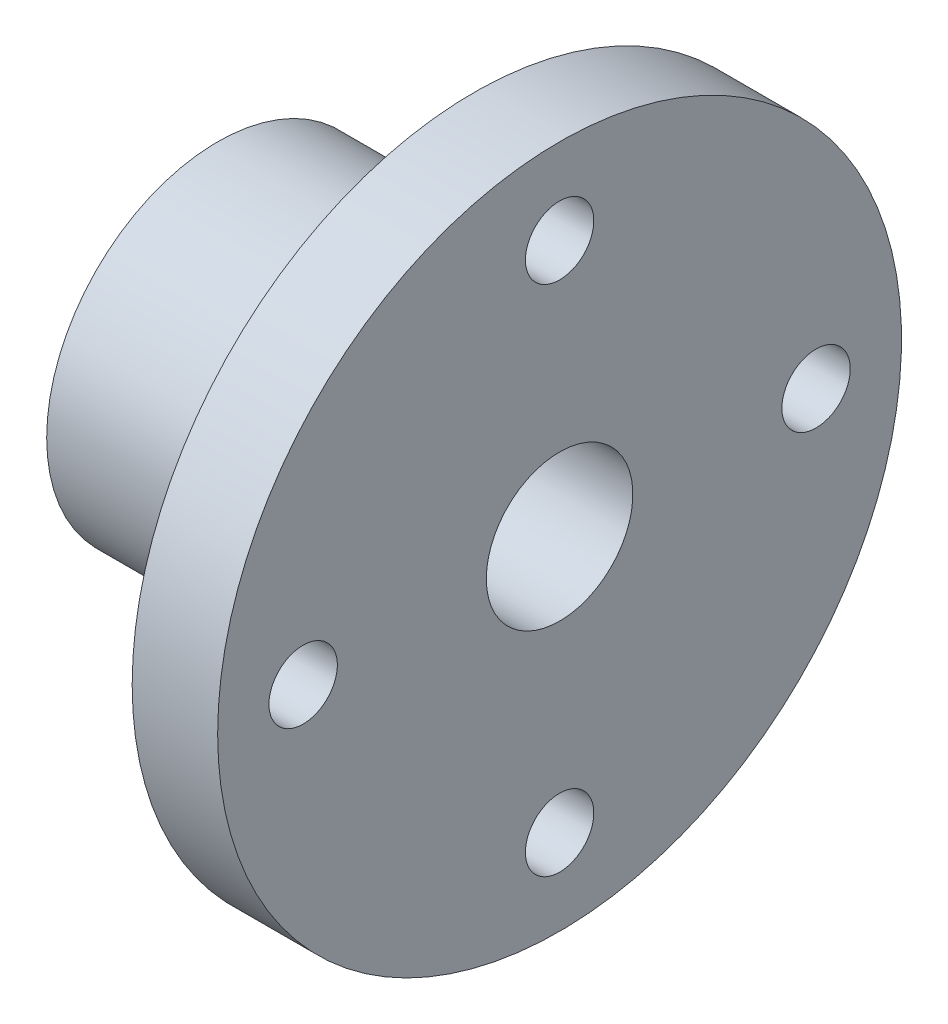
ISO-10303-21;
HEADER;
FILE_DESCRIPTION(('STEP AP214'),'2;1');
FILE_NAME('part.step','',(''),(''),'','','');
FILE_SCHEMA(('AUTOMOTIVE_DESIGN { 1 0 10303 214 1 1 1 1 }'));
ENDSEC;
DATA;
#1=APPLICATION_CONTEXT('core data for automotive mechanical design processes');
#2=APPLICATION_PROTOCOL_DEFINITION('international standard','automotive_design',2000,#1);
#3=PRODUCT_CONTEXT('',#1,'mechanical');
#4=PRODUCT('Part','Part','',(#3));
#5=PRODUCT_RELATED_PRODUCT_CATEGORY('part','',(#4));
#6=PRODUCT_DEFINITION_FORMATION('','',#4);
#7=PRODUCT_DEFINITION_CONTEXT('part definition',#1,'design');
#8=PRODUCT_DEFINITION('design','',#6,#7);
#9=PRODUCT_DEFINITION_SHAPE('','',#8);
#10=(LENGTH_UNIT() NAMED_UNIT(*) SI_UNIT(.MILLI.,.METRE.));
#11=(NAMED_UNIT(*) PLANE_ANGLE_UNIT() SI_UNIT($,.RADIAN.));
#12=(NAMED_UNIT(*) SI_UNIT($,.STERADIAN.) SOLID_ANGLE_UNIT());
#13=UNCERTAINTY_MEASURE_WITH_UNIT(LENGTH_MEASURE(1.E-05),#10,'distance_accuracy_value','');
#14=(GEOMETRIC_REPRESENTATION_CONTEXT(3) GLOBAL_UNCERTAINTY_ASSIGNED_CONTEXT((#13)) GLOBAL_UNIT_ASSIGNED_CONTEXT((#10,
#11,#12)) REPRESENTATION_CONTEXT('',''));
#15=CARTESIAN_POINT('',(0.,0.,0.));
#16=DIRECTION('',(0.,0.,1.));
#17=DIRECTION('',(1.,0.,0.));
#18=AXIS2_PLACEMENT_3D('',#15,#16,#17);
#19=CARTESIAN_POINT('',(12.0833333333333,0.,8.4));
#20=DIRECTION('',(-1.,0.,0.));
#21=DIRECTION('',(0.,0.,1.));
#22=AXIS2_PLACEMENT_3D('',#19,#20,#21);
#23=PLANE('',#22);
#24=CARTESIAN_POINT('',(12.0833333333333,0.,0.));
#25=DIRECTION('',(-1.,0.,0.));
#26=DIRECTION('',(0.,0.,1.));
#27=AXIS2_PLACEMENT_3D('',#24,#25,#26);
#28=CIRCLE('',#27,12.);
#29=CARTESIAN_POINT('',(12.0833333333333,0.,12.));
#30=VERTEX_POINT('',#29);
#31=EDGE_CURVE('E92',#30,#30,#28,.T.);
#32=ORIENTED_EDGE('',*,*,#31,.T.);
#33=EDGE_LOOP('',(#32));
#34=FACE_BOUND('',#33,.T.);
#35=CARTESIAN_POINT('',(12.0833333333333,0.,-42.));
#36=DIRECTION('',(-1.,0.,0.));
#37=DIRECTION('',(0.,0.,1.));
#38=AXIS2_PLACEMENT_3D('',#35,#36,#37);
#39=CIRCLE('',#38,5.6);
#40=CARTESIAN_POINT('',(12.0833333333333,0.,-36.4));
#41=VERTEX_POINT('',#40);
#42=EDGE_CURVE('E78',#41,#41,#39,.F.);
#43=ORIENTED_EDGE('',*,*,#42,.F.);
#44=EDGE_LOOP('',(#43));
#45=FACE_BOUND('',#44,.T.);
#46=CARTESIAN_POINT('',(12.0833333333333,0.,42.));
#47=DIRECTION('',(-1.,0.,0.));
#48=DIRECTION('',(0.,0.,1.));
#49=AXIS2_PLACEMENT_3D('',#46,#47,#48);
#50=CIRCLE('',#49,5.6);
#51=CARTESIAN_POINT('',(12.0833333333333,0.,47.6));
#52=VERTEX_POINT('',#51);
#53=EDGE_CURVE('E64',#52,#52,#50,.F.);
#54=ORIENTED_EDGE('',*,*,#53,.F.);
#55=EDGE_LOOP('',(#54));
#56=FACE_BOUND('',#55,.T.);
#57=CARTESIAN_POINT('',(12.0833333333333,0.,0.));
#58=DIRECTION('',(-1.,0.,0.));
#59=DIRECTION('',(0.,0.,1.));
#60=AXIS2_PLACEMENT_3D('',#57,#58,#59);
#61=CIRCLE('',#60,56.);
#62=CARTESIAN_POINT('',(12.0833333333333,0.,56.));
#63=VERTEX_POINT('',#62);
#64=EDGE_CURVE('E10',#63,#63,#61,.T.);
#65=ORIENTED_EDGE('',*,*,#64,.F.);
#66=EDGE_LOOP('',(#65));
#67=FACE_BOUND('',#66,.T.);
#68=CARTESIAN_POINT('',(12.0833333333333,-42.,0.));
#69=DIRECTION('',(-1.,0.,0.));
#70=DIRECTION('',(0.,0.,1.));
#71=AXIS2_PLACEMENT_3D('',#68,#69,#70);
#72=CIRCLE('',#71,5.6);
#73=CARTESIAN_POINT('',(12.0833333333333,-42.,5.6));
#74=VERTEX_POINT('',#73);
#75=EDGE_CURVE('E71',#74,#74,#72,.F.);
#76=ORIENTED_EDGE('',*,*,#75,.F.);
#77=EDGE_LOOP('',(#76));
#78=FACE_BOUND('',#77,.T.);
#79=CARTESIAN_POINT('',(12.0833333333333,42.,0.));
#80=DIRECTION('',(-1.,0.,0.));
#81=DIRECTION('',(0.,0.,1.));
#82=AXIS2_PLACEMENT_3D('',#79,#80,#81);
#83=CIRCLE('',#82,5.6);
#84=CARTESIAN_POINT('',(12.0833333333333,42.,5.6));
#85=VERTEX_POINT('',#84);
#86=EDGE_CURVE('E85',#85,#85,#83,.F.);
#87=ORIENTED_EDGE('',*,*,#86,.F.);
#88=EDGE_LOOP('',(#87));
#89=FACE_BOUND('',#88,.T.);
#90=ADVANCED_FACE('F45',(#34,#45,#56,#67,#78,#89),#23,.F.);
#91=CARTESIAN_POINT('',(-1.91666666666668,0.,56.));
#92=DIRECTION('',(1.,0.,0.));
#93=DIRECTION('',(0.,0.,-1.));
#94=AXIS2_PLACEMENT_3D('',#91,#92,#93);
#95=PLANE('',#94);
#96=CARTESIAN_POINT('',(-1.91666666666668,0.,-42.));
#97=DIRECTION('',(1.,0.,0.));
#98=DIRECTION('',(0.,1.,0.));
#99=AXIS2_PLACEMENT_3D('',#96,#97,#98);
#100=CIRCLE('',#99,5.6);
#101=CARTESIAN_POINT('',(-1.91666666666668,5.6,-42.));
#102=VERTEX_POINT('',#101);
#103=EDGE_CURVE('E81',#102,#102,#100,.T.);
#104=ORIENTED_EDGE('',*,*,#103,.T.);
#105=EDGE_LOOP('',(#104));
#106=FACE_BOUND('',#105,.T.);
#107=CARTESIAN_POINT('',(-1.91666666666668,0.,42.));
#108=DIRECTION('',(1.,0.,0.));
#109=DIRECTION('',(0.,-1.,0.));
#110=AXIS2_PLACEMENT_3D('',#107,#108,#109);
#111=CIRCLE('',#110,5.6);
#112=CARTESIAN_POINT('',(-1.91666666666668,-5.6,42.));
#113=VERTEX_POINT('',#112);
#114=EDGE_CURVE('E67',#113,#113,#111,.T.);
#115=ORIENTED_EDGE('',*,*,#114,.T.);
#116=EDGE_LOOP('',(#115));
#117=FACE_BOUND('',#116,.T.);
#118=CARTESIAN_POINT('',(-1.91666666666668,0.,0.));
#119=DIRECTION('',(-1.,0.,0.));
#120=DIRECTION('',(0.,0.,1.));
#121=AXIS2_PLACEMENT_3D('',#118,#119,#120);
#122=CIRCLE('',#121,28.);
#123=CARTESIAN_POINT('',(-1.91666666666668,0.,28.));
#124=VERTEX_POINT('',#123);
#125=EDGE_CURVE('E55',#124,#124,#122,.T.);
#126=ORIENTED_EDGE('',*,*,#125,.F.);
#127=EDGE_LOOP('',(#126));
#128=FACE_BOUND('',#127,.T.);
#129=CARTESIAN_POINT('',(-1.91666666666668,0.,0.));
#130=DIRECTION('',(-1.,0.,0.));
#131=DIRECTION('',(0.,0.,1.));
#132=AXIS2_PLACEMENT_3D('',#129,#130,#131);
#133=CIRCLE('',#132,56.);
#134=CARTESIAN_POINT('',(-1.91666666666668,0.,56.));
#135=VERTEX_POINT('',#134);
#136=EDGE_CURVE('E51',#135,#135,#133,.T.);
#137=ORIENTED_EDGE('',*,*,#136,.T.);
#138=EDGE_LOOP('',(#137));
#139=FACE_BOUND('',#138,.T.);
#140=CARTESIAN_POINT('',(-1.91666666666668,-42.,0.));
#141=DIRECTION('',(1.,0.,0.));
#142=DIRECTION('',(0.,0.,-1.));
#143=AXIS2_PLACEMENT_3D('',#140,#141,#142);
#144=CIRCLE('',#143,5.6);
#145=CARTESIAN_POINT('',(-1.91666666666668,-42.,-5.6));
#146=VERTEX_POINT('',#145);
#147=EDGE_CURVE('E74',#146,#146,#144,.T.);
#148=ORIENTED_EDGE('',*,*,#147,.T.);
#149=EDGE_LOOP('',(#148));
#150=FACE_BOUND('',#149,.T.);
#151=CARTESIAN_POINT('',(-1.91666666666668,42.,0.));
#152=DIRECTION('',(1.,0.,0.));
#153=DIRECTION('',(0.,0.,1.));
#154=AXIS2_PLACEMENT_3D('',#151,#152,#153);
#155=CIRCLE('',#154,5.6);
#156=CARTESIAN_POINT('',(-1.91666666666668,42.,5.6));
#157=VERTEX_POINT('',#156);
#158=EDGE_CURVE('E88',#157,#157,#155,.T.);
#159=ORIENTED_EDGE('',*,*,#158,.T.);
#160=EDGE_LOOP('',(#159));
#161=FACE_BOUND('',#160,.T.);
#162=ADVANCED_FACE('F122',(#106,#117,#128,#139,#150,#161),#95,.F.);
#163=CARTESIAN_POINT('',(-155.916666666667,0.,0.));
#164=DIRECTION('',(-1.,0.,0.));
#165=DIRECTION('',(0.,0.,1.));
#166=AXIS2_PLACEMENT_3D('',#163,#164,#165);
#167=CYLINDRICAL_SURFACE('',#166,56.);
#168=ORIENTED_EDGE('',*,*,#136,.F.);
#169=EDGE_LOOP('',(#168));
#170=FACE_BOUND('',#169,.T.);
#171=ORIENTED_EDGE('',*,*,#64,.T.);
#172=EDGE_LOOP('',(#171));
#173=FACE_BOUND('',#172,.T.);
#174=ADVANCED_FACE('F118',(#170,#173),#167,.T.);
#175=CARTESIAN_POINT('',(-155.916666666667,0.,0.));
#176=DIRECTION('',(-1.,0.,0.));
#177=DIRECTION('',(0.,0.,1.));
#178=AXIS2_PLACEMENT_3D('',#175,#176,#177);
#179=CYLINDRICAL_SURFACE('',#178,28.);
#180=CARTESIAN_POINT('',(-43.9166666666667,0.,0.));
#181=DIRECTION('',(-1.,0.,0.));
#182=DIRECTION('',(0.,0.,1.));
#183=AXIS2_PLACEMENT_3D('',#180,#181,#182);
#184=CIRCLE('',#183,28.);
#185=CARTESIAN_POINT('',(-43.9166666666667,0.,28.));
#186=VERTEX_POINT('',#185);
#187=EDGE_CURVE('E59',#186,#186,#184,.T.);
#188=ORIENTED_EDGE('',*,*,#187,.F.);
#189=EDGE_LOOP('',(#188));
#190=FACE_BOUND('',#189,.T.);
#191=ORIENTED_EDGE('',*,*,#125,.T.);
#192=EDGE_LOOP('',(#191));
#193=FACE_BOUND('',#192,.T.);
#194=ADVANCED_FACE('F112',(#190,#193),#179,.T.);
#195=CARTESIAN_POINT('',(-43.9166666666667,0.,28.));
#196=DIRECTION('',(1.,0.,0.));
#197=DIRECTION('',(0.,0.,-1.));
#198=AXIS2_PLACEMENT_3D('',#195,#196,#197);
#199=PLANE('',#198);
#200=CARTESIAN_POINT('',(-43.9166666666667,0.,0.));
#201=DIRECTION('',(-1.,0.,0.));
#202=DIRECTION('',(0.,0.,1.));
#203=AXIS2_PLACEMENT_3D('',#200,#201,#202);
#204=CIRCLE('',#203,12.);
#205=CARTESIAN_POINT('',(-43.9166666666667,0.,12.));
#206=VERTEX_POINT('',#205);
#207=EDGE_CURVE('E93',#206,#206,#204,.T.);
#208=ORIENTED_EDGE('',*,*,#207,.F.);
#209=EDGE_LOOP('',(#208));
#210=FACE_BOUND('',#209,.T.);
#211=ORIENTED_EDGE('',*,*,#187,.T.);
#212=EDGE_LOOP('',(#211));
#213=FACE_BOUND('',#212,.T.);
#214=ADVANCED_FACE('F108',(#210,#213),#199,.F.);
#215=CARTESIAN_POINT('',(131.433333333333,0.,42.));
#216=DIRECTION('',(-1.,0.,0.));
#217=DIRECTION('',(0.,0.,1.));
#218=AXIS2_PLACEMENT_3D('',#215,#216,#217);
#219=CYLINDRICAL_SURFACE('',#218,5.6);
#220=ORIENTED_EDGE('',*,*,#114,.F.);
#221=EDGE_LOOP('',(#220));
#222=FACE_BOUND('',#221,.T.);
#223=ORIENTED_EDGE('',*,*,#53,.T.);
#224=EDGE_LOOP('',(#223));
#225=FACE_BOUND('',#224,.T.);
#226=ADVANCED_FACE('F111',(#222,#225),#219,.F.);
#227=CARTESIAN_POINT('',(131.433333333333,-42.,0.));
#228=DIRECTION('',(-1.,0.,0.));
#229=DIRECTION('',(0.,0.,1.));
#230=AXIS2_PLACEMENT_3D('',#227,#228,#229);
#231=CYLINDRICAL_SURFACE('',#230,5.6);
#232=ORIENTED_EDGE('',*,*,#147,.F.);
#233=EDGE_LOOP('',(#232));
#234=FACE_BOUND('',#233,.T.);
#235=ORIENTED_EDGE('',*,*,#75,.T.);
#236=EDGE_LOOP('',(#235));
#237=FACE_BOUND('',#236,.T.);
#238=ADVANCED_FACE('F174',(#234,#237),#231,.F.);
#239=CARTESIAN_POINT('',(131.433333333333,0.,-42.));
#240=DIRECTION('',(-1.,0.,0.));
#241=DIRECTION('',(0.,0.,1.));
#242=AXIS2_PLACEMENT_3D('',#239,#240,#241);
#243=CYLINDRICAL_SURFACE('',#242,5.6);
#244=ORIENTED_EDGE('',*,*,#103,.F.);
#245=EDGE_LOOP('',(#244));
#246=FACE_BOUND('',#245,.T.);
#247=ORIENTED_EDGE('',*,*,#42,.T.);
#248=EDGE_LOOP('',(#247));
#249=FACE_BOUND('',#248,.T.);
#250=ADVANCED_FACE('F133',(#246,#249),#243,.F.);
#251=CARTESIAN_POINT('',(131.433333333333,42.,0.));
#252=DIRECTION('',(-1.,0.,0.));
#253=DIRECTION('',(0.,0.,1.));
#254=AXIS2_PLACEMENT_3D('',#251,#252,#253);
#255=CYLINDRICAL_SURFACE('',#254,5.6);
#256=ORIENTED_EDGE('',*,*,#158,.F.);
#257=EDGE_LOOP('',(#256));
#258=FACE_BOUND('',#257,.T.);
#259=ORIENTED_EDGE('',*,*,#86,.T.);
#260=EDGE_LOOP('',(#259));
#261=FACE_BOUND('',#260,.T.);
#262=ADVANCED_FACE('F104',(#258,#261),#255,.F.);
#263=CARTESIAN_POINT('',(12.0833333333333,0.,0.));
#264=DIRECTION('',(-1.,0.,0.));
#265=DIRECTION('',(0.,0.,1.));
#266=AXIS2_PLACEMENT_3D('',#263,#264,#265);
#267=CYLINDRICAL_SURFACE('',#266,12.);
#268=ORIENTED_EDGE('',*,*,#31,.F.);
#269=EDGE_LOOP('',(#268));
#270=FACE_BOUND('',#269,.T.);
#271=ORIENTED_EDGE('',*,*,#207,.T.);
#272=EDGE_LOOP('',(#271));
#273=FACE_BOUND('',#272,.T.);
#274=ADVANCED_FACE('F101',(#270,#273),#267,.F.);
#275=CLOSED_SHELL('',(#90,#162,#174,#194,#214,#226,#238,#250,#262,#274));
#276=MANIFOLD_SOLID_BREP('B2',#275);
#277=ADVANCED_BREP_SHAPE_REPRESENTATION('',(#18,#276),#14);
#278=SHAPE_DEFINITION_REPRESENTATION(#9,#277);
ENDSEC;
END-ISO-10303-21;
